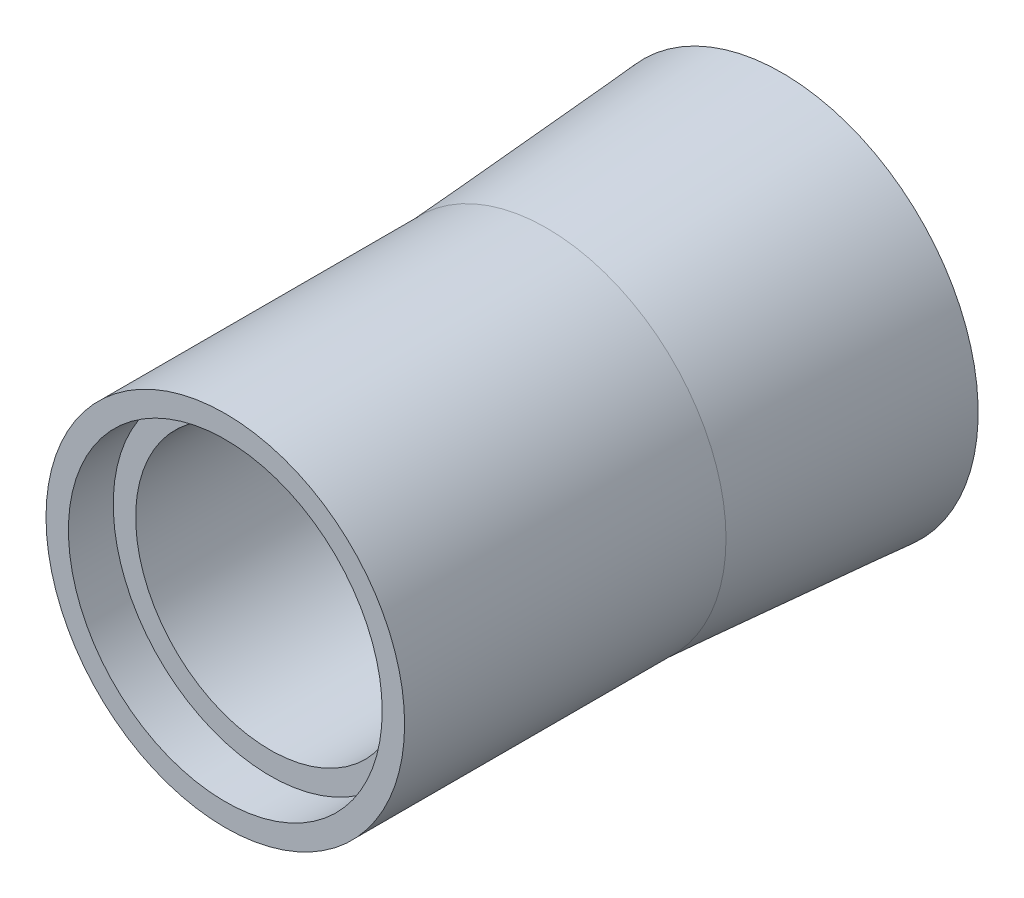
ISO-10303-21;
HEADER;
FILE_DESCRIPTION(('STEP AP214'),'2;1');
FILE_NAME('part.step','',(''),(''),'','','');
FILE_SCHEMA(('AUTOMOTIVE_DESIGN { 1 0 10303 214 1 1 1 1 }'));
ENDSEC;
DATA;
#1=APPLICATION_CONTEXT('core data for automotive mechanical design processes');
#2=APPLICATION_PROTOCOL_DEFINITION('international standard','automotive_design',2000,#1);
#3=PRODUCT_CONTEXT('',#1,'mechanical');
#4=PRODUCT('Part','Part','',(#3));
#5=PRODUCT_RELATED_PRODUCT_CATEGORY('part','',(#4));
#6=PRODUCT_DEFINITION_FORMATION('','',#4);
#7=PRODUCT_DEFINITION_CONTEXT('part definition',#1,'design');
#8=PRODUCT_DEFINITION('design','',#6,#7);
#9=PRODUCT_DEFINITION_SHAPE('','',#8);
#10=(LENGTH_UNIT() NAMED_UNIT(*) SI_UNIT(.MILLI.,.METRE.));
#11=(NAMED_UNIT(*) PLANE_ANGLE_UNIT() SI_UNIT($,.RADIAN.));
#12=(NAMED_UNIT(*) SI_UNIT($,.STERADIAN.) SOLID_ANGLE_UNIT());
#13=UNCERTAINTY_MEASURE_WITH_UNIT(LENGTH_MEASURE(1.E-05),#10,'distance_accuracy_value','');
#14=(GEOMETRIC_REPRESENTATION_CONTEXT(3) GLOBAL_UNCERTAINTY_ASSIGNED_CONTEXT((#13)) GLOBAL_UNIT_ASSIGNED_CONTEXT((#10,
#11,#12)) REPRESENTATION_CONTEXT('',''));
#15=CARTESIAN_POINT('',(0.,0.,0.));
#16=DIRECTION('',(0.,0.,1.));
#17=DIRECTION('',(1.,0.,0.));
#18=AXIS2_PLACEMENT_3D('',#15,#16,#17);
#19=CARTESIAN_POINT('',(0.,0.,157.734));
#20=DIRECTION('',(0.,0.,-1.));
#21=DIRECTION('',(-1.,0.,0.));
#22=AXIS2_PLACEMENT_3D('',#19,#20,#21);
#23=CYLINDRICAL_SURFACE('',#22,50.8);
#24=CARTESIAN_POINT('',(0.,0.,157.734));
#25=DIRECTION('',(0.,0.,1.));
#26=DIRECTION('',(1.,0.,0.));
#27=AXIS2_PLACEMENT_3D('',#24,#25,#26);
#28=CIRCLE('',#27,50.8);
#29=CARTESIAN_POINT('',(50.8,0.,157.734));
#30=VERTEX_POINT('',#29);
#31=EDGE_CURVE('E38',#30,#30,#28,.T.);
#32=ORIENTED_EDGE('',*,*,#31,.F.);
#33=EDGE_LOOP('',(#32));
#34=FACE_BOUND('',#33,.T.);
#35=CARTESIAN_POINT('',(0.,0.,66.6750000000001));
#36=DIRECTION('',(0.,0.,-1.));
#37=DIRECTION('',(-1.,0.,0.));
#38=AXIS2_PLACEMENT_3D('',#35,#36,#37);
#39=CIRCLE('',#38,50.8);
#40=CARTESIAN_POINT('',(-50.8,0.,66.6750000000001));
#41=VERTEX_POINT('',#40);
#42=EDGE_CURVE('E10',#41,#41,#39,.T.);
#43=ORIENTED_EDGE('',*,*,#42,.F.);
#44=EDGE_LOOP('',(#43));
#45=FACE_BOUND('',#44,.T.);
#46=ADVANCED_FACE('F32',(#34,#45),#23,.T.);
#47=CARTESIAN_POINT('',(0.,0.,157.734));
#48=DIRECTION('',(0.,0.,-1.));
#49=DIRECTION('',(-1.,0.,0.));
#50=AXIS2_PLACEMENT_3D('',#47,#48,#49);
#51=CYLINDRICAL_SURFACE('',#50,38.1);
#52=CARTESIAN_POINT('',(0.,0.,0.));
#53=DIRECTION('',(0.,0.,1.));
#54=DIRECTION('',(1.,0.,0.));
#55=AXIS2_PLACEMENT_3D('',#52,#53,#54);
#56=CIRCLE('',#55,38.1);
#57=CARTESIAN_POINT('',(38.1,0.,0.));
#58=VERTEX_POINT('',#57);
#59=EDGE_CURVE('E42',#58,#58,#56,.T.);
#60=ORIENTED_EDGE('',*,*,#59,.F.);
#61=EDGE_LOOP('',(#60));
#62=FACE_BOUND('',#61,.T.);
#63=CARTESIAN_POINT('',(0.,0.,145.034));
#64=DIRECTION('',(0.,0.,1.));
#65=DIRECTION('',(1.,0.,0.));
#66=AXIS2_PLACEMENT_3D('',#63,#64,#65);
#67=CIRCLE('',#66,38.1);
#68=CARTESIAN_POINT('',(38.1,0.,145.034));
#69=VERTEX_POINT('',#68);
#70=EDGE_CURVE('E47',#69,#69,#67,.T.);
#71=ORIENTED_EDGE('',*,*,#70,.T.);
#72=EDGE_LOOP('',(#71));
#73=FACE_BOUND('',#72,.T.);
#74=ADVANCED_FACE('F78',(#62,#73),#51,.F.);
#75=CARTESIAN_POINT('',(0.,0.,157.734));
#76=DIRECTION('',(0.,0.,1.));
#77=DIRECTION('',(1.,0.,0.));
#78=AXIS2_PLACEMENT_3D('',#75,#76,#77);
#79=PLANE('',#78);
#80=CARTESIAN_POINT('',(0.,0.,157.734));
#81=DIRECTION('',(0.,0.,1.));
#82=DIRECTION('',(1.,0.,0.));
#83=AXIS2_PLACEMENT_3D('',#80,#81,#82);
#84=CIRCLE('',#83,44.45);
#85=CARTESIAN_POINT('',(44.45,0.,157.734));
#86=VERTEX_POINT('',#85);
#87=EDGE_CURVE('E55',#86,#86,#84,.T.);
#88=ORIENTED_EDGE('',*,*,#87,.F.);
#89=EDGE_LOOP('',(#88));
#90=FACE_BOUND('',#89,.T.);
#91=ORIENTED_EDGE('',*,*,#31,.T.);
#92=EDGE_LOOP('',(#91));
#93=FACE_BOUND('',#92,.T.);
#94=ADVANCED_FACE('F83',(#90,#93),#79,.T.);
#95=CARTESIAN_POINT('',(0.,0.,0.));
#96=DIRECTION('',(0.,0.,1.));
#97=DIRECTION('',(1.,0.,0.));
#98=AXIS2_PLACEMENT_3D('',#95,#96,#97);
#99=PLANE('',#98);
#100=ORIENTED_EDGE('',*,*,#59,.T.);
#101=EDGE_LOOP('',(#100));
#102=FACE_BOUND('',#101,.T.);
#103=CARTESIAN_POINT('',(0.,0.,0.));
#104=DIRECTION('',(0.,0.,-1.));
#105=DIRECTION('',(-1.,0.,0.));
#106=AXIS2_PLACEMENT_3D('',#103,#104,#105);
#107=CIRCLE('',#106,55.5625);
#108=CARTESIAN_POINT('',(-55.5625,0.,0.));
#109=VERTEX_POINT('',#108);
#110=EDGE_CURVE('E60',#109,#109,#107,.T.);
#111=ORIENTED_EDGE('',*,*,#110,.T.);
#112=EDGE_LOOP('',(#111));
#113=FACE_BOUND('',#112,.T.);
#114=ADVANCED_FACE('F65',(#102,#113),#99,.F.);
#115=CARTESIAN_POINT('',(0.,0.,145.034));
#116=DIRECTION('',(0.,0.,1.));
#117=DIRECTION('',(1.,0.,0.));
#118=AXIS2_PLACEMENT_3D('',#115,#116,#117);
#119=CYLINDRICAL_SURFACE('',#118,44.45);
#120=CARTESIAN_POINT('',(0.,0.,145.034));
#121=DIRECTION('',(0.,0.,1.));
#122=DIRECTION('',(1.,0.,0.));
#123=AXIS2_PLACEMENT_3D('',#120,#121,#122);
#124=CIRCLE('',#123,44.45);
#125=CARTESIAN_POINT('',(44.45,0.,145.034));
#126=VERTEX_POINT('',#125);
#127=EDGE_CURVE('E51',#126,#126,#124,.T.);
#128=ORIENTED_EDGE('',*,*,#127,.F.);
#129=EDGE_LOOP('',(#128));
#130=FACE_BOUND('',#129,.T.);
#131=ORIENTED_EDGE('',*,*,#87,.T.);
#132=EDGE_LOOP('',(#131));
#133=FACE_BOUND('',#132,.T.);
#134=ADVANCED_FACE('F74',(#130,#133),#119,.F.);
#135=CARTESIAN_POINT('',(0.,0.,145.034));
#136=DIRECTION('',(0.,0.,1.));
#137=DIRECTION('',(1.,0.,0.));
#138=AXIS2_PLACEMENT_3D('',#135,#136,#137);
#139=PLANE('',#138);
#140=ORIENTED_EDGE('',*,*,#70,.F.);
#141=EDGE_LOOP('',(#140));
#142=FACE_BOUND('',#141,.T.);
#143=ORIENTED_EDGE('',*,*,#127,.T.);
#144=EDGE_LOOP('',(#143));
#145=FACE_BOUND('',#144,.T.);
#146=ADVANCED_FACE('F69',(#142,#145),#139,.T.);
#147=CARTESIAN_POINT('',(0.,0.,66.675));
#148=DIRECTION('',(0.,0.,-1.));
#149=DIRECTION('',(-1.,0.,0.));
#150=AXIS2_PLACEMENT_3D('',#147,#148,#149);
#151=CONICAL_SURFACE('',#150,50.8,0.0713074647852903);
#152=ORIENTED_EDGE('',*,*,#110,.F.);
#153=EDGE_LOOP('',(#152));
#154=FACE_BOUND('',#153,.T.);
#155=ORIENTED_EDGE('',*,*,#42,.T.);
#156=EDGE_LOOP('',(#155));
#157=FACE_BOUND('',#156,.T.);
#158=ADVANCED_FACE('F67',(#154,#157),#151,.T.);
#159=CLOSED_SHELL('',(#46,#74,#94,#114,#134,#146,#158));
#160=MANIFOLD_SOLID_BREP('B2',#159);
#161=ADVANCED_BREP_SHAPE_REPRESENTATION('',(#18,#160),#14);
#162=SHAPE_DEFINITION_REPRESENTATION(#9,#161);
ENDSEC;
END-ISO-10303-21;
